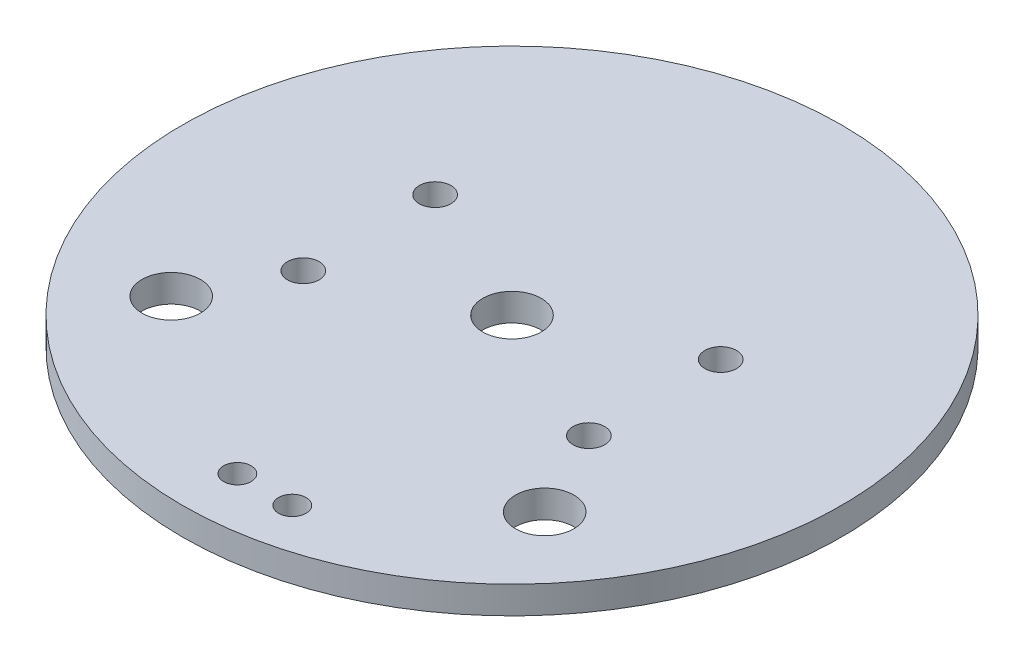
ISO-10303-21;
HEADER;
FILE_DESCRIPTION(('STEP AP214'),'2;1');
FILE_NAME('part.step','',(''),(''),'','','');
FILE_SCHEMA(('AUTOMOTIVE_DESIGN { 1 0 10303 214 1 1 1 1 }'));
ENDSEC;
DATA;
#1=APPLICATION_CONTEXT('core data for automotive mechanical design processes');
#2=APPLICATION_PROTOCOL_DEFINITION('international standard','automotive_design',2000,#1);
#3=PRODUCT_CONTEXT('',#1,'mechanical');
#4=PRODUCT('Part','Part','',(#3));
#5=PRODUCT_RELATED_PRODUCT_CATEGORY('part','',(#4));
#6=PRODUCT_DEFINITION_FORMATION('','',#4);
#7=PRODUCT_DEFINITION_CONTEXT('part definition',#1,'design');
#8=PRODUCT_DEFINITION('design','',#6,#7);
#9=PRODUCT_DEFINITION_SHAPE('','',#8);
#10=(LENGTH_UNIT() NAMED_UNIT(*) SI_UNIT(.MILLI.,.METRE.));
#11=(NAMED_UNIT(*) PLANE_ANGLE_UNIT() SI_UNIT($,.RADIAN.));
#12=(NAMED_UNIT(*) SI_UNIT($,.STERADIAN.) SOLID_ANGLE_UNIT());
#13=UNCERTAINTY_MEASURE_WITH_UNIT(LENGTH_MEASURE(1.E-05),#10,'distance_accuracy_value','');
#14=(GEOMETRIC_REPRESENTATION_CONTEXT(3) GLOBAL_UNCERTAINTY_ASSIGNED_CONTEXT((#13)) GLOBAL_UNIT_ASSIGNED_CONTEXT((#10,
#11,#12)) REPRESENTATION_CONTEXT('',''));
#15=CARTESIAN_POINT('',(0.,0.,0.));
#16=DIRECTION('',(0.,0.,1.));
#17=DIRECTION('',(1.,0.,0.));
#18=AXIS2_PLACEMENT_3D('',#15,#16,#17);
#19=CARTESIAN_POINT('',(0.,1.5875,0.));
#20=DIRECTION('',(0.,-1.,0.));
#21=DIRECTION('',(0.,0.,-1.));
#22=AXIS2_PLACEMENT_3D('',#19,#20,#21);
#23=CYLINDRICAL_SURFACE('',#22,38.1);
#24=CARTESIAN_POINT('',(0.,1.5875,0.));
#25=DIRECTION('',(0.,1.,0.));
#26=DIRECTION('',(0.,0.,1.));
#27=AXIS2_PLACEMENT_3D('',#24,#25,#26);
#28=CIRCLE('',#27,38.1);
#29=CARTESIAN_POINT('',(0.,1.5875,38.1));
#30=VERTEX_POINT('',#29);
#31=EDGE_CURVE('E10',#30,#30,#28,.T.);
#32=ORIENTED_EDGE('',*,*,#31,.F.);
#33=EDGE_LOOP('',(#32));
#34=FACE_BOUND('',#33,.T.);
#35=CARTESIAN_POINT('',(0.,-1.5875,0.));
#36=DIRECTION('',(0.,1.,0.));
#37=DIRECTION('',(0.,0.,1.));
#38=AXIS2_PLACEMENT_3D('',#35,#36,#37);
#39=CIRCLE('',#38,38.1);
#40=CARTESIAN_POINT('',(0.,-1.5875,38.1));
#41=VERTEX_POINT('',#40);
#42=EDGE_CURVE('E40',#41,#41,#39,.T.);
#43=ORIENTED_EDGE('',*,*,#42,.T.);
#44=EDGE_LOOP('',(#43));
#45=FACE_BOUND('',#44,.T.);
#46=ADVANCED_FACE('F37',(#34,#45),#23,.T.);
#47=CARTESIAN_POINT('',(0.,1.5875,0.));
#48=DIRECTION('',(0.,1.,0.));
#49=DIRECTION('',(0.,0.,1.));
#50=AXIS2_PLACEMENT_3D('',#47,#48,#49);
#51=PLANE('',#50);
#52=CARTESIAN_POINT('',(-16.51,1.5875,-7.62));
#53=DIRECTION('',(0.,1.,0.));
#54=DIRECTION('',(0.,0.,1.));
#55=AXIS2_PLACEMENT_3D('',#52,#53,#54);
#56=CIRCLE('',#55,1.8288);
#57=CARTESIAN_POINT('',(-16.51,1.5875,-5.7912));
#58=VERTEX_POINT('',#57);
#59=EDGE_CURVE('E119',#58,#58,#56,.T.);
#60=ORIENTED_EDGE('',*,*,#59,.F.);
#61=EDGE_LOOP('',(#60));
#62=FACE_BOUND('',#61,.T.);
#63=CARTESIAN_POINT('',(16.51,1.5875,-7.62));
#64=DIRECTION('',(0.,1.,0.));
#65=DIRECTION('',(0.,0.,1.));
#66=AXIS2_PLACEMENT_3D('',#63,#64,#65);
#67=CIRCLE('',#66,1.8288);
#68=CARTESIAN_POINT('',(16.51,1.5875,-5.7912));
#69=VERTEX_POINT('',#68);
#70=EDGE_CURVE('E111',#69,#69,#67,.T.);
#71=ORIENTED_EDGE('',*,*,#70,.F.);
#72=EDGE_LOOP('',(#71));
#73=FACE_BOUND('',#72,.T.);
#74=CARTESIAN_POINT('',(16.51,1.5875,7.62));
#75=DIRECTION('',(0.,1.,0.));
#76=DIRECTION('',(0.,0.,1.));
#77=AXIS2_PLACEMENT_3D('',#74,#75,#76);
#78=CIRCLE('',#77,1.8288);
#79=CARTESIAN_POINT('',(16.51,1.5875,9.4488));
#80=VERTEX_POINT('',#79);
#81=EDGE_CURVE('E103',#80,#80,#78,.T.);
#82=ORIENTED_EDGE('',*,*,#81,.F.);
#83=EDGE_LOOP('',(#82));
#84=FACE_BOUND('',#83,.T.);
#85=CARTESIAN_POINT('',(-16.51,1.5875,7.62));
#86=DIRECTION('',(0.,1.,0.));
#87=DIRECTION('',(0.,0.,1.));
#88=AXIS2_PLACEMENT_3D('',#85,#86,#87);
#89=CIRCLE('',#88,1.8288);
#90=CARTESIAN_POINT('',(-16.51,1.5875,9.4488));
#91=VERTEX_POINT('',#90);
#92=EDGE_CURVE('E95',#91,#91,#89,.T.);
#93=ORIENTED_EDGE('',*,*,#92,.F.);
#94=EDGE_LOOP('',(#93));
#95=FACE_BOUND('',#94,.T.);
#96=CARTESIAN_POINT('',(0.,1.5875,31.75));
#97=DIRECTION('',(0.,1.,0.));
#98=DIRECTION('',(0.,0.,1.));
#99=AXIS2_PLACEMENT_3D('',#96,#97,#98);
#100=CIRCLE('',#99,1.5875);
#101=CARTESIAN_POINT('',(0.,1.5875,33.3375));
#102=VERTEX_POINT('',#101);
#103=EDGE_CURVE('E87',#102,#102,#100,.T.);
#104=ORIENTED_EDGE('',*,*,#103,.F.);
#105=EDGE_LOOP('',(#104));
#106=FACE_BOUND('',#105,.T.);
#107=CARTESIAN_POINT('',(6.35,1.5875,31.75));
#108=DIRECTION('',(0.,1.,0.));
#109=DIRECTION('',(0.,0.,1.));
#110=AXIS2_PLACEMENT_3D('',#107,#108,#109);
#111=CIRCLE('',#110,1.5875);
#112=CARTESIAN_POINT('',(6.35,1.5875,33.3375));
#113=VERTEX_POINT('',#112);
#114=EDGE_CURVE('E79',#113,#113,#111,.T.);
#115=ORIENTED_EDGE('',*,*,#114,.F.);
#116=EDGE_LOOP('',(#115));
#117=FACE_BOUND('',#116,.T.);
#118=CARTESIAN_POINT('',(0.,1.5875,0.));
#119=DIRECTION('',(0.,1.,0.));
#120=DIRECTION('',(0.,0.,1.));
#121=AXIS2_PLACEMENT_3D('',#118,#119,#120);
#122=CIRCLE('',#121,3.37819999999999);
#123=CARTESIAN_POINT('',(0.,1.5875,3.37819999999999));
#124=VERTEX_POINT('',#123);
#125=EDGE_CURVE('E71',#124,#124,#122,.T.);
#126=ORIENTED_EDGE('',*,*,#125,.F.);
#127=EDGE_LOOP('',(#126));
#128=FACE_BOUND('',#127,.T.);
#129=CARTESIAN_POINT('',(-21.59,1.5875,17.810706314));
#130=DIRECTION('',(0.,1.,0.));
#131=DIRECTION('',(0.,0.,1.));
#132=AXIS2_PLACEMENT_3D('',#129,#130,#131);
#133=CIRCLE('',#132,3.37819999999999);
#134=CARTESIAN_POINT('',(-21.59,1.5875,21.188906314));
#135=VERTEX_POINT('',#134);
#136=EDGE_CURVE('E63',#135,#135,#133,.T.);
#137=ORIENTED_EDGE('',*,*,#136,.F.);
#138=EDGE_LOOP('',(#137));
#139=FACE_BOUND('',#138,.T.);
#140=CARTESIAN_POINT('',(21.59,1.5875,17.810706314));
#141=DIRECTION('',(0.,1.,0.));
#142=DIRECTION('',(0.,0.,1.));
#143=AXIS2_PLACEMENT_3D('',#140,#141,#142);
#144=CIRCLE('',#143,3.37819999999999);
#145=CARTESIAN_POINT('',(21.59,1.5875,21.188906314));
#146=VERTEX_POINT('',#145);
#147=EDGE_CURVE('E55',#146,#146,#144,.T.);
#148=ORIENTED_EDGE('',*,*,#147,.F.);
#149=EDGE_LOOP('',(#148));
#150=FACE_BOUND('',#149,.T.);
#151=ORIENTED_EDGE('',*,*,#31,.T.);
#152=EDGE_LOOP('',(#151));
#153=FACE_BOUND('',#152,.T.);
#154=ADVANCED_FACE('F127',(#62,#73,#84,#95,#106,#117,#128,#139,#150,#153),#51,.T.);
#155=CARTESIAN_POINT('',(0.,-1.5875,0.));
#156=DIRECTION('',(0.,1.,0.));
#157=DIRECTION('',(0.,0.,1.));
#158=AXIS2_PLACEMENT_3D('',#155,#156,#157);
#159=PLANE('',#158);
#160=CARTESIAN_POINT('',(-16.51,-1.5875,-7.62));
#161=DIRECTION('',(0.,1.,0.));
#162=DIRECTION('',(0.,0.,1.));
#163=AXIS2_PLACEMENT_3D('',#160,#161,#162);
#164=CIRCLE('',#163,1.8288);
#165=CARTESIAN_POINT('',(-16.51,-1.5875,-5.7912));
#166=VERTEX_POINT('',#165);
#167=EDGE_CURVE('E115',#166,#166,#164,.T.);
#168=ORIENTED_EDGE('',*,*,#167,.T.);
#169=EDGE_LOOP('',(#168));
#170=FACE_BOUND('',#169,.T.);
#171=CARTESIAN_POINT('',(16.51,-1.5875,-7.62));
#172=DIRECTION('',(0.,1.,0.));
#173=DIRECTION('',(0.,0.,1.));
#174=AXIS2_PLACEMENT_3D('',#171,#172,#173);
#175=CIRCLE('',#174,1.8288);
#176=CARTESIAN_POINT('',(16.51,-1.5875,-5.7912));
#177=VERTEX_POINT('',#176);
#178=EDGE_CURVE('E107',#177,#177,#175,.T.);
#179=ORIENTED_EDGE('',*,*,#178,.T.);
#180=EDGE_LOOP('',(#179));
#181=FACE_BOUND('',#180,.T.);
#182=CARTESIAN_POINT('',(16.51,-1.5875,7.62));
#183=DIRECTION('',(0.,1.,0.));
#184=DIRECTION('',(0.,0.,1.));
#185=AXIS2_PLACEMENT_3D('',#182,#183,#184);
#186=CIRCLE('',#185,1.8288);
#187=CARTESIAN_POINT('',(16.51,-1.5875,9.4488));
#188=VERTEX_POINT('',#187);
#189=EDGE_CURVE('E99',#188,#188,#186,.T.);
#190=ORIENTED_EDGE('',*,*,#189,.T.);
#191=EDGE_LOOP('',(#190));
#192=FACE_BOUND('',#191,.T.);
#193=CARTESIAN_POINT('',(-16.51,-1.5875,7.62));
#194=DIRECTION('',(0.,1.,0.));
#195=DIRECTION('',(0.,0.,1.));
#196=AXIS2_PLACEMENT_3D('',#193,#194,#195);
#197=CIRCLE('',#196,1.8288);
#198=CARTESIAN_POINT('',(-16.51,-1.5875,9.4488));
#199=VERTEX_POINT('',#198);
#200=EDGE_CURVE('E91',#199,#199,#197,.T.);
#201=ORIENTED_EDGE('',*,*,#200,.T.);
#202=EDGE_LOOP('',(#201));
#203=FACE_BOUND('',#202,.T.);
#204=CARTESIAN_POINT('',(0.,-1.5875,31.75));
#205=DIRECTION('',(0.,1.,0.));
#206=DIRECTION('',(0.,0.,1.));
#207=AXIS2_PLACEMENT_3D('',#204,#205,#206);
#208=CIRCLE('',#207,1.5875);
#209=CARTESIAN_POINT('',(0.,-1.5875,33.3375));
#210=VERTEX_POINT('',#209);
#211=EDGE_CURVE('E83',#210,#210,#208,.T.);
#212=ORIENTED_EDGE('',*,*,#211,.T.);
#213=EDGE_LOOP('',(#212));
#214=FACE_BOUND('',#213,.T.);
#215=CARTESIAN_POINT('',(6.35,-1.5875,31.75));
#216=DIRECTION('',(0.,1.,0.));
#217=DIRECTION('',(0.,0.,1.));
#218=AXIS2_PLACEMENT_3D('',#215,#216,#217);
#219=CIRCLE('',#218,1.5875);
#220=CARTESIAN_POINT('',(6.35,-1.5875,33.3375));
#221=VERTEX_POINT('',#220);
#222=EDGE_CURVE('E75',#221,#221,#219,.T.);
#223=ORIENTED_EDGE('',*,*,#222,.T.);
#224=EDGE_LOOP('',(#223));
#225=FACE_BOUND('',#224,.T.);
#226=CARTESIAN_POINT('',(0.,-1.5875,0.));
#227=DIRECTION('',(0.,1.,0.));
#228=DIRECTION('',(0.,0.,1.));
#229=AXIS2_PLACEMENT_3D('',#226,#227,#228);
#230=CIRCLE('',#229,3.37819999999998);
#231=CARTESIAN_POINT('',(0.,-1.5875,3.37819999999998));
#232=VERTEX_POINT('',#231);
#233=EDGE_CURVE('E67',#232,#232,#230,.T.);
#234=ORIENTED_EDGE('',*,*,#233,.T.);
#235=EDGE_LOOP('',(#234));
#236=FACE_BOUND('',#235,.T.);
#237=CARTESIAN_POINT('',(-21.59,-1.5875,17.810706314));
#238=DIRECTION('',(0.,1.,0.));
#239=DIRECTION('',(0.,0.,1.));
#240=AXIS2_PLACEMENT_3D('',#237,#238,#239);
#241=CIRCLE('',#240,3.37819999999998);
#242=CARTESIAN_POINT('',(-21.59,-1.5875,21.188906314));
#243=VERTEX_POINT('',#242);
#244=EDGE_CURVE('E59',#243,#243,#241,.T.);
#245=ORIENTED_EDGE('',*,*,#244,.T.);
#246=EDGE_LOOP('',(#245));
#247=FACE_BOUND('',#246,.T.);
#248=CARTESIAN_POINT('',(21.59,-1.5875,17.810706314));
#249=DIRECTION('',(0.,1.,0.));
#250=DIRECTION('',(0.,0.,1.));
#251=AXIS2_PLACEMENT_3D('',#248,#249,#250);
#252=CIRCLE('',#251,3.37819999999998);
#253=CARTESIAN_POINT('',(21.59,-1.5875,21.188906314));
#254=VERTEX_POINT('',#253);
#255=EDGE_CURVE('E50',#254,#254,#252,.T.);
#256=ORIENTED_EDGE('',*,*,#255,.T.);
#257=EDGE_LOOP('',(#256));
#258=FACE_BOUND('',#257,.T.);
#259=ORIENTED_EDGE('',*,*,#42,.F.);
#260=EDGE_LOOP('',(#259));
#261=FACE_BOUND('',#260,.T.);
#262=ADVANCED_FACE('F130',(#170,#181,#192,#203,#214,#225,#236,#247,#258,#261),#159,.F.);
#263=CARTESIAN_POINT('',(21.59,1.5875,17.810706314));
#264=DIRECTION('',(0.,1.,0.));
#265=DIRECTION('',(0.,0.,1.));
#266=AXIS2_PLACEMENT_3D('',#263,#264,#265);
#267=CYLINDRICAL_SURFACE('',#266,3.37819999999999);
#268=ORIENTED_EDGE('',*,*,#255,.F.);
#269=EDGE_LOOP('',(#268));
#270=FACE_BOUND('',#269,.T.);
#271=ORIENTED_EDGE('',*,*,#147,.T.);
#272=EDGE_LOOP('',(#271));
#273=FACE_BOUND('',#272,.T.);
#274=ADVANCED_FACE('F148',(#270,#273),#267,.F.);
#275=CARTESIAN_POINT('',(-21.59,1.5875,17.810706314));
#276=DIRECTION('',(0.,1.,0.));
#277=DIRECTION('',(0.,0.,1.));
#278=AXIS2_PLACEMENT_3D('',#275,#276,#277);
#279=CYLINDRICAL_SURFACE('',#278,3.37819999999999);
#280=ORIENTED_EDGE('',*,*,#244,.F.);
#281=EDGE_LOOP('',(#280));
#282=FACE_BOUND('',#281,.T.);
#283=ORIENTED_EDGE('',*,*,#136,.T.);
#284=EDGE_LOOP('',(#283));
#285=FACE_BOUND('',#284,.T.);
#286=ADVANCED_FACE('F150',(#282,#285),#279,.F.);
#287=CARTESIAN_POINT('',(0.,1.5875,0.));
#288=DIRECTION('',(0.,1.,0.));
#289=DIRECTION('',(0.,0.,1.));
#290=AXIS2_PLACEMENT_3D('',#287,#288,#289);
#291=CYLINDRICAL_SURFACE('',#290,3.37819999999999);
#292=ORIENTED_EDGE('',*,*,#233,.F.);
#293=EDGE_LOOP('',(#292));
#294=FACE_BOUND('',#293,.T.);
#295=ORIENTED_EDGE('',*,*,#125,.T.);
#296=EDGE_LOOP('',(#295));
#297=FACE_BOUND('',#296,.T.);
#298=ADVANCED_FACE('F157',(#294,#297),#291,.F.);
#299=CARTESIAN_POINT('',(6.35,1.5875,31.75));
#300=DIRECTION('',(0.,1.,0.));
#301=DIRECTION('',(0.,0.,1.));
#302=AXIS2_PLACEMENT_3D('',#299,#300,#301);
#303=CYLINDRICAL_SURFACE('',#302,1.5875);
#304=ORIENTED_EDGE('',*,*,#222,.F.);
#305=EDGE_LOOP('',(#304));
#306=FACE_BOUND('',#305,.T.);
#307=ORIENTED_EDGE('',*,*,#114,.T.);
#308=EDGE_LOOP('',(#307));
#309=FACE_BOUND('',#308,.T.);
#310=ADVANCED_FACE('F237',(#306,#309),#303,.F.);
#311=CARTESIAN_POINT('',(0.,1.5875,31.75));
#312=DIRECTION('',(0.,1.,0.));
#313=DIRECTION('',(0.,0.,1.));
#314=AXIS2_PLACEMENT_3D('',#311,#312,#313);
#315=CYLINDRICAL_SURFACE('',#314,1.5875);
#316=ORIENTED_EDGE('',*,*,#211,.F.);
#317=EDGE_LOOP('',(#316));
#318=FACE_BOUND('',#317,.T.);
#319=ORIENTED_EDGE('',*,*,#103,.T.);
#320=EDGE_LOOP('',(#319));
#321=FACE_BOUND('',#320,.T.);
#322=ADVANCED_FACE('F191',(#318,#321),#315,.F.);
#323=CARTESIAN_POINT('',(-16.51,1.5875,7.62));
#324=DIRECTION('',(0.,1.,0.));
#325=DIRECTION('',(0.,0.,1.));
#326=AXIS2_PLACEMENT_3D('',#323,#324,#325);
#327=CYLINDRICAL_SURFACE('',#326,1.8288);
#328=ORIENTED_EDGE('',*,*,#200,.F.);
#329=EDGE_LOOP('',(#328));
#330=FACE_BOUND('',#329,.T.);
#331=ORIENTED_EDGE('',*,*,#92,.T.);
#332=EDGE_LOOP('',(#331));
#333=FACE_BOUND('',#332,.T.);
#334=ADVANCED_FACE('F185',(#330,#333),#327,.F.);
#335=CARTESIAN_POINT('',(16.51,1.5875,7.62));
#336=DIRECTION('',(0.,1.,0.));
#337=DIRECTION('',(0.,0.,1.));
#338=AXIS2_PLACEMENT_3D('',#335,#336,#337);
#339=CYLINDRICAL_SURFACE('',#338,1.8288);
#340=ORIENTED_EDGE('',*,*,#189,.F.);
#341=EDGE_LOOP('',(#340));
#342=FACE_BOUND('',#341,.T.);
#343=ORIENTED_EDGE('',*,*,#81,.T.);
#344=EDGE_LOOP('',(#343));
#345=FACE_BOUND('',#344,.T.);
#346=ADVANCED_FACE('F190',(#342,#345),#339,.F.);
#347=CARTESIAN_POINT('',(16.51,1.5875,-7.62));
#348=DIRECTION('',(0.,1.,0.));
#349=DIRECTION('',(0.,0.,1.));
#350=AXIS2_PLACEMENT_3D('',#347,#348,#349);
#351=CYLINDRICAL_SURFACE('',#350,1.8288);
#352=ORIENTED_EDGE('',*,*,#178,.F.);
#353=EDGE_LOOP('',(#352));
#354=FACE_BOUND('',#353,.T.);
#355=ORIENTED_EDGE('',*,*,#70,.T.);
#356=EDGE_LOOP('',(#355));
#357=FACE_BOUND('',#356,.T.);
#358=ADVANCED_FACE('F204',(#354,#357),#351,.F.);
#359=CARTESIAN_POINT('',(-16.51,1.5875,-7.62));
#360=DIRECTION('',(0.,1.,0.));
#361=DIRECTION('',(0.,0.,1.));
#362=AXIS2_PLACEMENT_3D('',#359,#360,#361);
#363=CYLINDRICAL_SURFACE('',#362,1.8288);
#364=ORIENTED_EDGE('',*,*,#167,.F.);
#365=EDGE_LOOP('',(#364));
#366=FACE_BOUND('',#365,.T.);
#367=ORIENTED_EDGE('',*,*,#59,.T.);
#368=EDGE_LOOP('',(#367));
#369=FACE_BOUND('',#368,.T.);
#370=ADVANCED_FACE('F125',(#366,#369),#363,.F.);
#371=CLOSED_SHELL('',(#46,#154,#262,#274,#286,#298,#310,#322,#334,#346,#358,#370));
#372=MANIFOLD_SOLID_BREP('B2',#371);
#373=ADVANCED_BREP_SHAPE_REPRESENTATION('',(#18,#372),#14);
#374=SHAPE_DEFINITION_REPRESENTATION(#9,#373);
ENDSEC;
END-ISO-10303-21;
